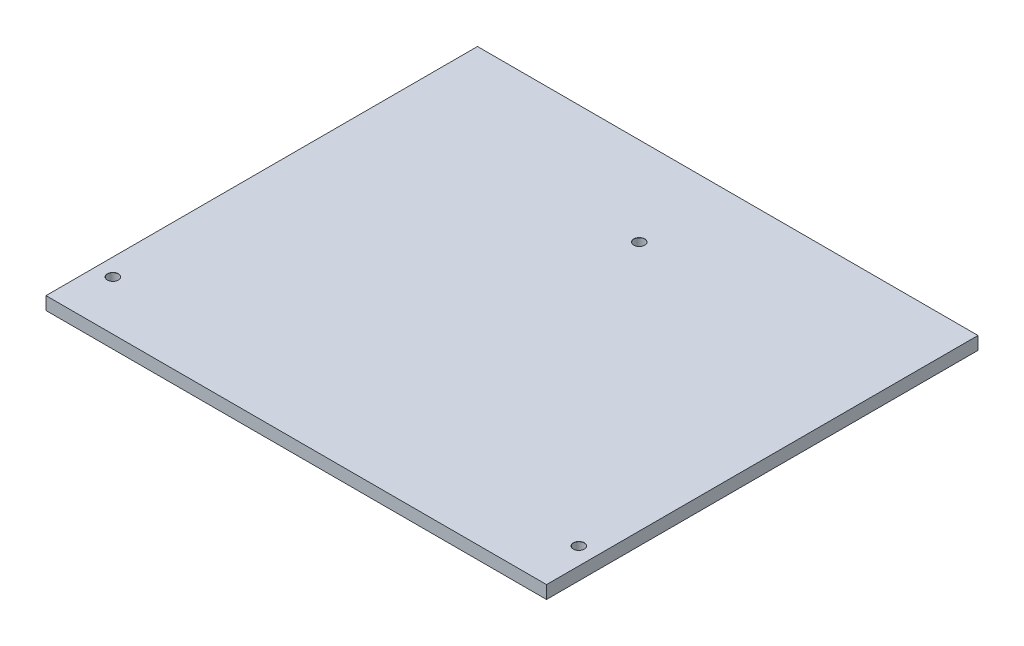
ISO-10303-21;
HEADER;
FILE_DESCRIPTION(('STEP AP214'),'2;1');
FILE_NAME('part.step','',(''),(''),'','','');
FILE_SCHEMA(('AUTOMOTIVE_DESIGN { 1 0 10303 214 1 1 1 1 }'));
ENDSEC;
DATA;
#1=APPLICATION_CONTEXT('core data for automotive mechanical design processes');
#2=APPLICATION_PROTOCOL_DEFINITION('international standard','automotive_design',2000,#1);
#3=PRODUCT_CONTEXT('',#1,'mechanical');
#4=PRODUCT('Part','Part','',(#3));
#5=PRODUCT_RELATED_PRODUCT_CATEGORY('part','',(#4));
#6=PRODUCT_DEFINITION_FORMATION('','',#4);
#7=PRODUCT_DEFINITION_CONTEXT('part definition',#1,'design');
#8=PRODUCT_DEFINITION('design','',#6,#7);
#9=PRODUCT_DEFINITION_SHAPE('','',#8);
#10=(LENGTH_UNIT() NAMED_UNIT(*) SI_UNIT(.MILLI.,.METRE.));
#11=(NAMED_UNIT(*) PLANE_ANGLE_UNIT() SI_UNIT($,.RADIAN.));
#12=(NAMED_UNIT(*) SI_UNIT($,.STERADIAN.) SOLID_ANGLE_UNIT());
#13=UNCERTAINTY_MEASURE_WITH_UNIT(LENGTH_MEASURE(1.E-05),#10,'distance_accuracy_value','');
#14=(GEOMETRIC_REPRESENTATION_CONTEXT(3) GLOBAL_UNCERTAINTY_ASSIGNED_CONTEXT((#13)) GLOBAL_UNIT_ASSIGNED_CONTEXT((#10,
#11,#12)) REPRESENTATION_CONTEXT('',''));
#15=CARTESIAN_POINT('',(0.,0.,0.));
#16=DIRECTION('',(0.,0.,1.));
#17=DIRECTION('',(1.,0.,0.));
#18=AXIS2_PLACEMENT_3D('',#15,#16,#17);
#19=CARTESIAN_POINT('',(58.,3.,50.));
#20=DIRECTION('',(-1.,0.,0.));
#21=DIRECTION('',(0.,0.,1.));
#22=AXIS2_PLACEMENT_3D('',#19,#20,#21);
#23=PLANE('',#22);
#24=DIRECTION('',(0.,0.,-1.));
#25=VECTOR('',#24,1.);
#26=CARTESIAN_POINT('',(58.,0.,50.));
#27=LINE('',#26,#25);
#28=CARTESIAN_POINT('',(58.,0.,50.));
#29=VERTEX_POINT('',#28);
#30=CARTESIAN_POINT('',(58.,0.,-50.));
#31=VERTEX_POINT('',#30);
#32=EDGE_CURVE('E106',#29,#31,#27,.T.);
#33=ORIENTED_EDGE('',*,*,#32,.T.);
#34=DIRECTION('',(0.,-1.,0.));
#35=VECTOR('',#34,1.);
#36=CARTESIAN_POINT('',(58.,3.,-50.));
#37=LINE('',#36,#35);
#38=CARTESIAN_POINT('',(58.,3.,-50.));
#39=VERTEX_POINT('',#38);
#40=EDGE_CURVE('E11',#39,#31,#37,.T.);
#41=ORIENTED_EDGE('',*,*,#40,.F.);
#42=DIRECTION('',(0.,0.,-1.));
#43=VECTOR('',#42,1.);
#44=CARTESIAN_POINT('',(58.,3.,50.));
#45=LINE('',#44,#43);
#46=CARTESIAN_POINT('',(58.,3.,50.));
#47=VERTEX_POINT('',#46);
#48=EDGE_CURVE('E90',#47,#39,#45,.T.);
#49=ORIENTED_EDGE('',*,*,#48,.F.);
#50=DIRECTION('',(0.,-1.,0.));
#51=VECTOR('',#50,1.);
#52=CARTESIAN_POINT('',(58.,3.,50.));
#53=LINE('',#52,#51);
#54=EDGE_CURVE('E102',#47,#29,#53,.T.);
#55=ORIENTED_EDGE('',*,*,#54,.T.);
#56=EDGE_LOOP('',(#33,#41,#49,#55));
#57=FACE_BOUND('',#56,.T.);
#58=ADVANCED_FACE('F38',(#57),#23,.F.);
#59=CARTESIAN_POINT('',(-58.,3.,-50.));
#60=DIRECTION('',(0.,0.,1.));
#61=DIRECTION('',(1.,0.,0.));
#62=AXIS2_PLACEMENT_3D('',#59,#60,#61);
#63=PLANE('',#62);
#64=DIRECTION('',(-1.,0.,0.));
#65=VECTOR('',#64,1.);
#66=CARTESIAN_POINT('',(-58.,0.,-50.));
#67=LINE('',#66,#65);
#68=CARTESIAN_POINT('',(-58.,0.,-50.));
#69=VERTEX_POINT('',#68);
#70=EDGE_CURVE('E95',#31,#69,#67,.T.);
#71=ORIENTED_EDGE('',*,*,#70,.T.);
#72=DIRECTION('',(0.,-1.,0.));
#73=VECTOR('',#72,1.);
#74=CARTESIAN_POINT('',(-58.,3.,-50.));
#75=LINE('',#74,#73);
#76=CARTESIAN_POINT('',(-58.,3.,-50.));
#77=VERTEX_POINT('',#76);
#78=EDGE_CURVE('E47',#77,#69,#75,.T.);
#79=ORIENTED_EDGE('',*,*,#78,.F.);
#80=DIRECTION('',(-1.,0.,0.));
#81=VECTOR('',#80,1.);
#82=CARTESIAN_POINT('',(-58.,3.,-50.));
#83=LINE('',#82,#81);
#84=EDGE_CURVE('E85',#39,#77,#83,.T.);
#85=ORIENTED_EDGE('',*,*,#84,.F.);
#86=ORIENTED_EDGE('',*,*,#40,.T.);
#87=EDGE_LOOP('',(#71,#79,#85,#86));
#88=FACE_BOUND('',#87,.T.);
#89=ADVANCED_FACE('F94',(#88),#63,.F.);
#90=CARTESIAN_POINT('',(-58.,3.,50.));
#91=DIRECTION('',(1.,0.,0.));
#92=DIRECTION('',(0.,0.,-1.));
#93=AXIS2_PLACEMENT_3D('',#90,#91,#92);
#94=PLANE('',#93);
#95=DIRECTION('',(0.,0.,1.));
#96=VECTOR('',#95,1.);
#97=CARTESIAN_POINT('',(-58.,0.,50.));
#98=LINE('',#97,#96);
#99=CARTESIAN_POINT('',(-58.,0.,50.));
#100=VERTEX_POINT('',#99);
#101=EDGE_CURVE('E72',#69,#100,#98,.T.);
#102=ORIENTED_EDGE('',*,*,#101,.T.);
#103=DIRECTION('',(0.,-1.,0.));
#104=VECTOR('',#103,1.);
#105=CARTESIAN_POINT('',(-58.,3.,50.));
#106=LINE('',#105,#104);
#107=CARTESIAN_POINT('',(-58.,3.,50.));
#108=VERTEX_POINT('',#107);
#109=EDGE_CURVE('E97',#108,#100,#106,.T.);
#110=ORIENTED_EDGE('',*,*,#109,.F.);
#111=DIRECTION('',(0.,0.,1.));
#112=VECTOR('',#111,1.);
#113=CARTESIAN_POINT('',(-58.,3.,50.));
#114=LINE('',#113,#112);
#115=EDGE_CURVE('E88',#77,#108,#114,.T.);
#116=ORIENTED_EDGE('',*,*,#115,.F.);
#117=ORIENTED_EDGE('',*,*,#78,.T.);
#118=EDGE_LOOP('',(#102,#110,#116,#117));
#119=FACE_BOUND('',#118,.T.);
#120=ADVANCED_FACE('F98',(#119),#94,.F.);
#121=CARTESIAN_POINT('',(-58.,3.,50.));
#122=DIRECTION('',(0.,0.,-1.));
#123=DIRECTION('',(-1.,0.,0.));
#124=AXIS2_PLACEMENT_3D('',#121,#122,#123);
#125=PLANE('',#124);
#126=DIRECTION('',(1.,0.,0.));
#127=VECTOR('',#126,1.);
#128=CARTESIAN_POINT('',(-58.,0.,50.));
#129=LINE('',#128,#127);
#130=EDGE_CURVE('E78',#100,#29,#129,.T.);
#131=ORIENTED_EDGE('',*,*,#130,.T.);
#132=ORIENTED_EDGE('',*,*,#54,.F.);
#133=DIRECTION('',(1.,0.,0.));
#134=VECTOR('',#133,1.);
#135=CARTESIAN_POINT('',(-58.,3.,50.));
#136=LINE('',#135,#134);
#137=EDGE_CURVE('E55',#108,#47,#136,.T.);
#138=ORIENTED_EDGE('',*,*,#137,.F.);
#139=ORIENTED_EDGE('',*,*,#109,.T.);
#140=EDGE_LOOP('',(#131,#132,#138,#139));
#141=FACE_BOUND('',#140,.T.);
#142=ADVANCED_FACE('F120',(#141),#125,.F.);
#143=CARTESIAN_POINT('',(0.,3.,0.));
#144=DIRECTION('',(0.,-1.,0.));
#145=DIRECTION('',(0.,0.,-1.));
#146=AXIS2_PLACEMENT_3D('',#143,#144,#145);
#147=PLANE('',#146);
#148=CARTESIAN_POINT('',(0.,3.,-29.5));
#149=DIRECTION('',(0.,1.,0.));
#150=DIRECTION('',(0.,0.,1.));
#151=AXIS2_PLACEMENT_3D('',#148,#149,#150);
#152=CIRCLE('',#151,1.275);
#153=CARTESIAN_POINT('',(0.,3.,-28.225));
#154=VERTEX_POINT('',#153);
#155=EDGE_CURVE('E158',#154,#154,#152,.T.);
#156=ORIENTED_EDGE('',*,*,#155,.F.);
#157=EDGE_LOOP('',(#156));
#158=FACE_BOUND('',#157,.T.);
#159=CARTESIAN_POINT('',(-54.,3.,38.5));
#160=DIRECTION('',(0.,1.,0.));
#161=DIRECTION('',(0.,0.,1.));
#162=AXIS2_PLACEMENT_3D('',#159,#160,#161);
#163=CIRCLE('',#162,1.275);
#164=CARTESIAN_POINT('',(-54.,3.,39.775));
#165=VERTEX_POINT('',#164);
#166=EDGE_CURVE('E146',#165,#165,#163,.T.);
#167=ORIENTED_EDGE('',*,*,#166,.F.);
#168=EDGE_LOOP('',(#167));
#169=FACE_BOUND('',#168,.T.);
#170=CARTESIAN_POINT('',(54.,3.,38.5));
#171=DIRECTION('',(0.,1.,0.));
#172=DIRECTION('',(0.,0.,1.));
#173=AXIS2_PLACEMENT_3D('',#170,#171,#172);
#174=CIRCLE('',#173,1.275);
#175=CARTESIAN_POINT('',(54.,3.,39.775));
#176=VERTEX_POINT('',#175);
#177=EDGE_CURVE('E134',#176,#176,#174,.T.);
#178=ORIENTED_EDGE('',*,*,#177,.F.);
#179=EDGE_LOOP('',(#178));
#180=FACE_BOUND('',#179,.T.);
#181=ORIENTED_EDGE('',*,*,#48,.T.);
#182=ORIENTED_EDGE('',*,*,#84,.T.);
#183=ORIENTED_EDGE('',*,*,#115,.T.);
#184=ORIENTED_EDGE('',*,*,#137,.T.);
#185=EDGE_LOOP('',(#181,#182,#183,#184));
#186=FACE_BOUND('',#185,.T.);
#187=ADVANCED_FACE('F86',(#158,#169,#180,#186),#147,.F.);
#188=CARTESIAN_POINT('',(0.,0.,0.));
#189=DIRECTION('',(0.,-1.,0.));
#190=DIRECTION('',(0.,0.,-1.));
#191=AXIS2_PLACEMENT_3D('',#188,#189,#190);
#192=PLANE('',#191);
#193=CARTESIAN_POINT('',(0.,0.,-29.5));
#194=DIRECTION('',(0.,1.,0.));
#195=DIRECTION('',(0.,0.,1.));
#196=AXIS2_PLACEMENT_3D('',#193,#194,#195);
#197=CIRCLE('',#196,1.25);
#198=CARTESIAN_POINT('',(0.,0.,-28.25));
#199=VERTEX_POINT('',#198);
#200=EDGE_CURVE('E150',#199,#199,#197,.T.);
#201=ORIENTED_EDGE('',*,*,#200,.T.);
#202=EDGE_LOOP('',(#201));
#203=FACE_BOUND('',#202,.T.);
#204=CARTESIAN_POINT('',(-54.,0.,38.5));
#205=DIRECTION('',(0.,1.,0.));
#206=DIRECTION('',(0.,0.,1.));
#207=AXIS2_PLACEMENT_3D('',#204,#205,#206);
#208=CIRCLE('',#207,1.25);
#209=CARTESIAN_POINT('',(-54.,0.,39.75));
#210=VERTEX_POINT('',#209);
#211=EDGE_CURVE('E138',#210,#210,#208,.T.);
#212=ORIENTED_EDGE('',*,*,#211,.T.);
#213=EDGE_LOOP('',(#212));
#214=FACE_BOUND('',#213,.T.);
#215=CARTESIAN_POINT('',(54.,0.,38.5));
#216=DIRECTION('',(0.,1.,0.));
#217=DIRECTION('',(0.,0.,1.));
#218=AXIS2_PLACEMENT_3D('',#215,#216,#217);
#219=CIRCLE('',#218,1.25);
#220=CARTESIAN_POINT('',(54.,0.,39.75));
#221=VERTEX_POINT('',#220);
#222=EDGE_CURVE('E110',#221,#221,#219,.T.);
#223=ORIENTED_EDGE('',*,*,#222,.T.);
#224=EDGE_LOOP('',(#223));
#225=FACE_BOUND('',#224,.T.);
#226=ORIENTED_EDGE('',*,*,#32,.F.);
#227=ORIENTED_EDGE('',*,*,#130,.F.);
#228=ORIENTED_EDGE('',*,*,#101,.F.);
#229=ORIENTED_EDGE('',*,*,#70,.F.);
#230=EDGE_LOOP('',(#226,#227,#228,#229));
#231=FACE_BOUND('',#230,.T.);
#232=ADVANCED_FACE('F123',(#203,#214,#225,#231),#192,.T.);
#233=CARTESIAN_POINT('',(54.,3.,38.5));
#234=DIRECTION('',(0.,1.,0.));
#235=DIRECTION('',(0.,0.,1.));
#236=AXIS2_PLACEMENT_3D('',#233,#234,#235);
#237=CYLINDRICAL_SURFACE('',#236,1.24999999999999);
#238=ORIENTED_EDGE('',*,*,#222,.F.);
#239=EDGE_LOOP('',(#238));
#240=FACE_BOUND('',#239,.T.);
#241=CARTESIAN_POINT('',(54.,2.97499999999998,38.5));
#242=DIRECTION('',(0.,1.,0.));
#243=DIRECTION('',(0.,0.,1.));
#244=AXIS2_PLACEMENT_3D('',#241,#242,#243);
#245=CIRCLE('',#244,1.24999999999999);
#246=CARTESIAN_POINT('',(54.,2.97499999999998,39.75));
#247=VERTEX_POINT('',#246);
#248=EDGE_CURVE('E130',#247,#247,#245,.T.);
#249=ORIENTED_EDGE('',*,*,#248,.T.);
#250=EDGE_LOOP('',(#249));
#251=FACE_BOUND('',#250,.T.);
#252=ADVANCED_FACE('F175',(#240,#251),#237,.F.);
#253=CARTESIAN_POINT('',(54.,3.,38.5));
#254=DIRECTION('',(0.,1.,0.));
#255=DIRECTION('',(0.,0.,1.));
#256=AXIS2_PLACEMENT_3D('',#253,#254,#255);
#257=CONICAL_SURFACE('',#256,1.275,0.785398163397136);
#258=ORIENTED_EDGE('',*,*,#248,.F.);
#259=EDGE_LOOP('',(#258));
#260=FACE_BOUND('',#259,.T.);
#261=ORIENTED_EDGE('',*,*,#177,.T.);
#262=EDGE_LOOP('',(#261));
#263=FACE_BOUND('',#262,.T.);
#264=ADVANCED_FACE('F172',(#260,#263),#257,.F.);
#265=CARTESIAN_POINT('',(-54.,3.,38.5));
#266=DIRECTION('',(0.,1.,0.));
#267=DIRECTION('',(0.,0.,1.));
#268=AXIS2_PLACEMENT_3D('',#265,#266,#267);
#269=CYLINDRICAL_SURFACE('',#268,1.24999999999999);
#270=ORIENTED_EDGE('',*,*,#211,.F.);
#271=EDGE_LOOP('',(#270));
#272=FACE_BOUND('',#271,.T.);
#273=CARTESIAN_POINT('',(-54.,2.97499999999998,38.5));
#274=DIRECTION('',(0.,1.,0.));
#275=DIRECTION('',(0.,0.,1.));
#276=AXIS2_PLACEMENT_3D('',#273,#274,#275);
#277=CIRCLE('',#276,1.24999999999999);
#278=CARTESIAN_POINT('',(-54.,2.97499999999998,39.75));
#279=VERTEX_POINT('',#278);
#280=EDGE_CURVE('E142',#279,#279,#277,.T.);
#281=ORIENTED_EDGE('',*,*,#280,.T.);
#282=EDGE_LOOP('',(#281));
#283=FACE_BOUND('',#282,.T.);
#284=ADVANCED_FACE('F174',(#272,#283),#269,.F.);
#285=CARTESIAN_POINT('',(-54.,3.,38.5));
#286=DIRECTION('',(0.,1.,0.));
#287=DIRECTION('',(0.,0.,1.));
#288=AXIS2_PLACEMENT_3D('',#285,#286,#287);
#289=CONICAL_SURFACE('',#288,1.275,0.785398163397136);
#290=ORIENTED_EDGE('',*,*,#280,.F.);
#291=EDGE_LOOP('',(#290));
#292=FACE_BOUND('',#291,.T.);
#293=ORIENTED_EDGE('',*,*,#166,.T.);
#294=EDGE_LOOP('',(#293));
#295=FACE_BOUND('',#294,.T.);
#296=ADVANCED_FACE('F182',(#292,#295),#289,.F.);
#297=CARTESIAN_POINT('',(0.,3.,-29.5));
#298=DIRECTION('',(0.,1.,0.));
#299=DIRECTION('',(0.,0.,1.));
#300=AXIS2_PLACEMENT_3D('',#297,#298,#299);
#301=CYLINDRICAL_SURFACE('',#300,1.24999999999999);
#302=ORIENTED_EDGE('',*,*,#200,.F.);
#303=EDGE_LOOP('',(#302));
#304=FACE_BOUND('',#303,.T.);
#305=CARTESIAN_POINT('',(0.,2.97499999999998,-29.5));
#306=DIRECTION('',(0.,1.,0.));
#307=DIRECTION('',(0.,0.,1.));
#308=AXIS2_PLACEMENT_3D('',#305,#306,#307);
#309=CIRCLE('',#308,1.24999999999999);
#310=CARTESIAN_POINT('',(0.,2.97499999999998,-28.25));
#311=VERTEX_POINT('',#310);
#312=EDGE_CURVE('E154',#311,#311,#309,.T.);
#313=ORIENTED_EDGE('',*,*,#312,.T.);
#314=EDGE_LOOP('',(#313));
#315=FACE_BOUND('',#314,.T.);
#316=ADVANCED_FACE('F215',(#304,#315),#301,.F.);
#317=CARTESIAN_POINT('',(0.,3.,-29.5));
#318=DIRECTION('',(0.,1.,0.));
#319=DIRECTION('',(0.,0.,1.));
#320=AXIS2_PLACEMENT_3D('',#317,#318,#319);
#321=CONICAL_SURFACE('',#320,1.275,0.785398163397171);
#322=ORIENTED_EDGE('',*,*,#312,.F.);
#323=EDGE_LOOP('',(#322));
#324=FACE_BOUND('',#323,.T.);
#325=ORIENTED_EDGE('',*,*,#155,.T.);
#326=EDGE_LOOP('',(#325));
#327=FACE_BOUND('',#326,.T.);
#328=ADVANCED_FACE('F163',(#324,#327),#321,.F.);
#329=CLOSED_SHELL('',(#58,#89,#120,#142,#187,#232,#252,#264,#284,#296,#316,#328));
#330=MANIFOLD_SOLID_BREP('B2',#329);
#331=ADVANCED_BREP_SHAPE_REPRESENTATION('',(#18,#330),#14);
#332=SHAPE_DEFINITION_REPRESENTATION(#9,#331);
ENDSEC;
END-ISO-10303-21;
